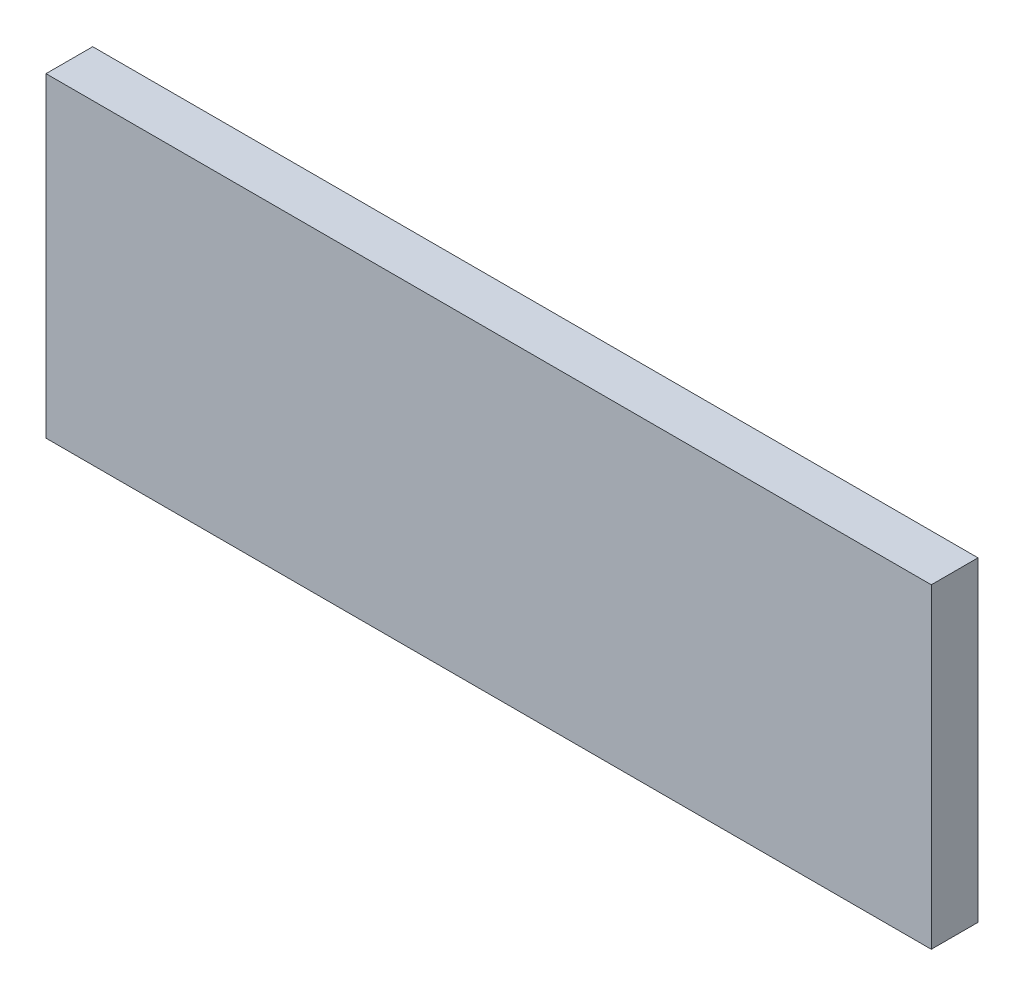
ISO-10303-21;
HEADER;
FILE_DESCRIPTION(('STEP AP214'),'2;1');
FILE_NAME('part.step','',(''),(''),'','','');
FILE_SCHEMA(('AUTOMOTIVE_DESIGN { 1 0 10303 214 1 1 1 1 }'));
ENDSEC;
DATA;
#1=APPLICATION_CONTEXT('core data for automotive mechanical design processes');
#2=APPLICATION_PROTOCOL_DEFINITION('international standard','automotive_design',2000,#1);
#3=PRODUCT_CONTEXT('',#1,'mechanical');
#4=PRODUCT('Part','Part','',(#3));
#5=PRODUCT_RELATED_PRODUCT_CATEGORY('part','',(#4));
#6=PRODUCT_DEFINITION_FORMATION('','',#4);
#7=PRODUCT_DEFINITION_CONTEXT('part definition',#1,'design');
#8=PRODUCT_DEFINITION('design','',#6,#7);
#9=PRODUCT_DEFINITION_SHAPE('','',#8);
#10=(LENGTH_UNIT() NAMED_UNIT(*) SI_UNIT(.MILLI.,.METRE.));
#11=(NAMED_UNIT(*) PLANE_ANGLE_UNIT() SI_UNIT($,.RADIAN.));
#12=(NAMED_UNIT(*) SI_UNIT($,.STERADIAN.) SOLID_ANGLE_UNIT());
#13=UNCERTAINTY_MEASURE_WITH_UNIT(LENGTH_MEASURE(1.E-05),#10,'distance_accuracy_value','');
#14=(GEOMETRIC_REPRESENTATION_CONTEXT(3) GLOBAL_UNCERTAINTY_ASSIGNED_CONTEXT((#13)) GLOBAL_UNIT_ASSIGNED_CONTEXT((#10,
#11,#12)) REPRESENTATION_CONTEXT('',''));
#15=CARTESIAN_POINT('',(0.,0.,0.));
#16=DIRECTION('',(0.,0.,1.));
#17=DIRECTION('',(1.,0.,0.));
#18=AXIS2_PLACEMENT_3D('',#15,#16,#17);
#19=CARTESIAN_POINT('',(142.171197327286,50.6999996129078,15.));
#20=DIRECTION('',(-1.,0.,0.));
#21=DIRECTION('',(0.,0.,1.));
#22=AXIS2_PLACEMENT_3D('',#19,#20,#21);
#23=PLANE('',#22);
#24=DIRECTION('',(0.,1.,0.));
#25=VECTOR('',#24,1.);
#26=CARTESIAN_POINT('',(142.171197327286,50.6999996129078,0.));
#27=LINE('',#26,#25);
#28=CARTESIAN_POINT('',(142.171197327286,-50.6999996129078,0.));
#29=VERTEX_POINT('',#28);
#30=CARTESIAN_POINT('',(142.171197327286,50.6999996129078,0.));
#31=VERTEX_POINT('',#30);
#32=EDGE_CURVE('E100',#29,#31,#27,.T.);
#33=ORIENTED_EDGE('',*,*,#32,.T.);
#34=DIRECTION('',(0.,0.,-1.));
#35=VECTOR('',#34,1.);
#36=CARTESIAN_POINT('',(142.171197327286,50.6999996129078,15.));
#37=LINE('',#36,#35);
#38=CARTESIAN_POINT('',(142.171197327286,50.6999996129078,15.));
#39=VERTEX_POINT('',#38);
#40=EDGE_CURVE('E11',#39,#31,#37,.T.);
#41=ORIENTED_EDGE('',*,*,#40,.F.);
#42=DIRECTION('',(0.,1.,0.));
#43=VECTOR('',#42,1.);
#44=CARTESIAN_POINT('',(142.171197327286,50.6999996129078,15.));
#45=LINE('',#44,#43);
#46=CARTESIAN_POINT('',(142.171197327286,-50.6999996129078,15.));
#47=VERTEX_POINT('',#46);
#48=EDGE_CURVE('E88',#47,#39,#45,.T.);
#49=ORIENTED_EDGE('',*,*,#48,.F.);
#50=DIRECTION('',(0.,0.,-1.));
#51=VECTOR('',#50,1.);
#52=CARTESIAN_POINT('',(142.171197327286,-50.6999996129078,15.));
#53=LINE('',#52,#51);
#54=EDGE_CURVE('E96',#47,#29,#53,.T.);
#55=ORIENTED_EDGE('',*,*,#54,.T.);
#56=EDGE_LOOP('',(#33,#41,#49,#55));
#57=FACE_BOUND('',#56,.T.);
#58=ADVANCED_FACE('F37',(#57),#23,.F.);
#59=CARTESIAN_POINT('',(-142.171197327286,50.6999996129078,15.));
#60=DIRECTION('',(0.,-1.,0.));
#61=DIRECTION('',(0.,0.,-1.));
#62=AXIS2_PLACEMENT_3D('',#59,#60,#61);
#63=PLANE('',#62);
#64=DIRECTION('',(-1.,0.,0.));
#65=VECTOR('',#64,1.);
#66=CARTESIAN_POINT('',(-142.171197327286,50.6999996129078,0.));
#67=LINE('',#66,#65);
#68=CARTESIAN_POINT('',(-142.171197327286,50.6999996129078,0.));
#69=VERTEX_POINT('',#68);
#70=EDGE_CURVE('E92',#31,#69,#67,.T.);
#71=ORIENTED_EDGE('',*,*,#70,.T.);
#72=DIRECTION('',(0.,0.,-1.));
#73=VECTOR('',#72,1.);
#74=CARTESIAN_POINT('',(-142.171197327286,50.6999996129078,15.));
#75=LINE('',#74,#73);
#76=CARTESIAN_POINT('',(-142.171197327286,50.6999996129078,15.));
#77=VERTEX_POINT('',#76);
#78=EDGE_CURVE('E45',#77,#69,#75,.T.);
#79=ORIENTED_EDGE('',*,*,#78,.F.);
#80=DIRECTION('',(-1.,0.,0.));
#81=VECTOR('',#80,1.);
#82=CARTESIAN_POINT('',(-142.171197327286,50.6999996129078,15.));
#83=LINE('',#82,#81);
#84=EDGE_CURVE('E83',#39,#77,#83,.T.);
#85=ORIENTED_EDGE('',*,*,#84,.F.);
#86=ORIENTED_EDGE('',*,*,#40,.T.);
#87=EDGE_LOOP('',(#71,#79,#85,#86));
#88=FACE_BOUND('',#87,.T.);
#89=ADVANCED_FACE('F91',(#88),#63,.F.);
#90=CARTESIAN_POINT('',(-142.171197327286,50.6999996129078,15.));
#91=DIRECTION('',(1.,0.,0.));
#92=DIRECTION('',(0.,1.,0.));
#93=AXIS2_PLACEMENT_3D('',#90,#91,#92);
#94=PLANE('',#93);
#95=DIRECTION('',(0.,-1.,0.));
#96=VECTOR('',#95,1.);
#97=CARTESIAN_POINT('',(-142.171197327286,50.6999996129078,0.));
#98=LINE('',#97,#96);
#99=CARTESIAN_POINT('',(-142.171197327286,-50.6999996129078,0.));
#100=VERTEX_POINT('',#99);
#101=EDGE_CURVE('E70',#69,#100,#98,.T.);
#102=ORIENTED_EDGE('',*,*,#101,.T.);
#103=DIRECTION('',(0.,0.,-1.));
#104=VECTOR('',#103,1.);
#105=CARTESIAN_POINT('',(-142.171197327286,-50.6999996129078,15.));
#106=LINE('',#105,#104);
#107=CARTESIAN_POINT('',(-142.171197327286,-50.6999996129078,15.));
#108=VERTEX_POINT('',#107);
#109=EDGE_CURVE('E93',#108,#100,#106,.T.);
#110=ORIENTED_EDGE('',*,*,#109,.F.);
#111=DIRECTION('',(0.,-1.,0.));
#112=VECTOR('',#111,1.);
#113=CARTESIAN_POINT('',(-142.171197327286,50.6999996129078,15.));
#114=LINE('',#113,#112);
#115=EDGE_CURVE('E86',#77,#108,#114,.T.);
#116=ORIENTED_EDGE('',*,*,#115,.F.);
#117=ORIENTED_EDGE('',*,*,#78,.T.);
#118=EDGE_LOOP('',(#102,#110,#116,#117));
#119=FACE_BOUND('',#118,.T.);
#120=ADVANCED_FACE('F94',(#119),#94,.F.);
#121=CARTESIAN_POINT('',(-142.171197327286,-50.6999996129078,15.));
#122=DIRECTION('',(0.,1.,0.));
#123=DIRECTION('',(0.,0.,1.));
#124=AXIS2_PLACEMENT_3D('',#121,#122,#123);
#125=PLANE('',#124);
#126=DIRECTION('',(1.,0.,0.));
#127=VECTOR('',#126,1.);
#128=CARTESIAN_POINT('',(-142.171197327286,-50.6999996129078,0.));
#129=LINE('',#128,#127);
#130=EDGE_CURVE('E76',#100,#29,#129,.T.);
#131=ORIENTED_EDGE('',*,*,#130,.T.);
#132=ORIENTED_EDGE('',*,*,#54,.F.);
#133=DIRECTION('',(1.,0.,0.));
#134=VECTOR('',#133,1.);
#135=CARTESIAN_POINT('',(-142.171197327286,-50.6999996129078,15.));
#136=LINE('',#135,#134);
#137=EDGE_CURVE('E53',#108,#47,#136,.T.);
#138=ORIENTED_EDGE('',*,*,#137,.F.);
#139=ORIENTED_EDGE('',*,*,#109,.T.);
#140=EDGE_LOOP('',(#131,#132,#138,#139));
#141=FACE_BOUND('',#140,.T.);
#142=ADVANCED_FACE('F107',(#141),#125,.F.);
#143=CARTESIAN_POINT('',(0.,0.,15.));
#144=DIRECTION('',(0.,0.,1.));
#145=DIRECTION('',(1.,0.,0.));
#146=AXIS2_PLACEMENT_3D('',#143,#144,#145);
#147=PLANE('',#146);
#148=ORIENTED_EDGE('',*,*,#48,.T.);
#149=ORIENTED_EDGE('',*,*,#84,.T.);
#150=ORIENTED_EDGE('',*,*,#115,.T.);
#151=ORIENTED_EDGE('',*,*,#137,.T.);
#152=EDGE_LOOP('',(#148,#149,#150,#151));
#153=FACE_BOUND('',#152,.T.);
#154=ADVANCED_FACE('F84',(#153),#147,.T.);
#155=CARTESIAN_POINT('',(0.,0.,0.));
#156=DIRECTION('',(0.,0.,1.));
#157=DIRECTION('',(1.,0.,0.));
#158=AXIS2_PLACEMENT_3D('',#155,#156,#157);
#159=PLANE('',#158);
#160=ORIENTED_EDGE('',*,*,#32,.F.);
#161=ORIENTED_EDGE('',*,*,#130,.F.);
#162=ORIENTED_EDGE('',*,*,#101,.F.);
#163=ORIENTED_EDGE('',*,*,#70,.F.);
#164=EDGE_LOOP('',(#160,#161,#162,#163));
#165=FACE_BOUND('',#164,.T.);
#166=ADVANCED_FACE('F110',(#165),#159,.F.);
#167=CLOSED_SHELL('',(#58,#89,#120,#142,#154,#166));
#168=MANIFOLD_SOLID_BREP('B2',#167);
#169=ADVANCED_BREP_SHAPE_REPRESENTATION('',(#18,#168),#14);
#170=SHAPE_DEFINITION_REPRESENTATION(#9,#169);
ENDSEC;
END-ISO-10303-21;
